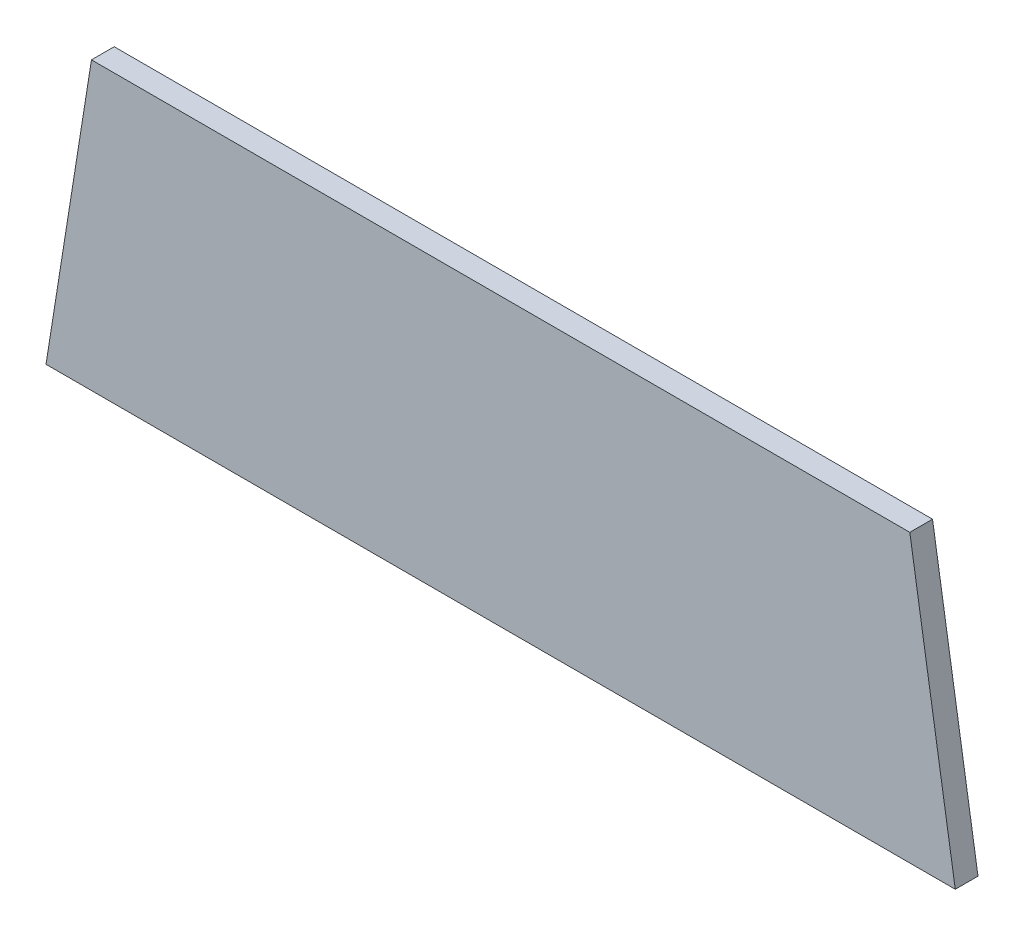
ISO-10303-21;
HEADER;
FILE_DESCRIPTION(('STEP AP214'),'2;1');
FILE_NAME('part.step','',(''),(''),'','','');
FILE_SCHEMA(('AUTOMOTIVE_DESIGN { 1 0 10303 214 1 1 1 1 }'));
ENDSEC;
DATA;
#1=APPLICATION_CONTEXT('core data for automotive mechanical design processes');
#2=APPLICATION_PROTOCOL_DEFINITION('international standard','automotive_design',2000,#1);
#3=PRODUCT_CONTEXT('',#1,'mechanical');
#4=PRODUCT('Part','Part','',(#3));
#5=PRODUCT_RELATED_PRODUCT_CATEGORY('part','',(#4));
#6=PRODUCT_DEFINITION_FORMATION('','',#4);
#7=PRODUCT_DEFINITION_CONTEXT('part definition',#1,'design');
#8=PRODUCT_DEFINITION('design','',#6,#7);
#9=PRODUCT_DEFINITION_SHAPE('','',#8);
#10=(LENGTH_UNIT() NAMED_UNIT(*) SI_UNIT(.MILLI.,.METRE.));
#11=(NAMED_UNIT(*) PLANE_ANGLE_UNIT() SI_UNIT($,.RADIAN.));
#12=(NAMED_UNIT(*) SI_UNIT($,.STERADIAN.) SOLID_ANGLE_UNIT());
#13=UNCERTAINTY_MEASURE_WITH_UNIT(LENGTH_MEASURE(1.E-05),#10,'distance_accuracy_value','');
#14=(GEOMETRIC_REPRESENTATION_CONTEXT(3) GLOBAL_UNCERTAINTY_ASSIGNED_CONTEXT((#13)) GLOBAL_UNIT_ASSIGNED_CONTEXT((#10,
#11,#12)) REPRESENTATION_CONTEXT('',''));
#15=CARTESIAN_POINT('',(0.,0.,0.));
#16=DIRECTION('',(0.,0.,1.));
#17=DIRECTION('',(1.,0.,0.));
#18=AXIS2_PLACEMENT_3D('',#15,#16,#17);
#19=CARTESIAN_POINT('',(-0.90000074,0.31500064,0.0499999));
#20=DIRECTION('',(0.,0.,1.));
#21=DIRECTION('',(1.,0.,0.));
#22=AXIS2_PLACEMENT_3D('',#19,#20,#21);
#23=PLANE('',#22);
#24=DIRECTION('',(-0.156766927688066,0.987635626323415,0.));
#25=VECTOR('',#24,1.);
#26=CARTESIAN_POINT('',(0.90000074,0.31500064,0.0499999));
#27=LINE('',#26,#25);
#28=CARTESIAN_POINT('',(0.90000074,0.31500064,0.0499999));
#29=VERTEX_POINT('',#28);
#30=CARTESIAN_POINT('',(1.00000053999998,-0.315000640000003,0.0499999));
#31=VERTEX_POINT('',#30);
#32=EDGE_CURVE('E52',#29,#31,#27,.F.);
#33=ORIENTED_EDGE('',*,*,#32,.F.);
#34=DIRECTION('',(1.,0.,0.));
#35=VECTOR('',#34,1.);
#36=CARTESIAN_POINT('',(-0.90000074,0.31500064,0.0499999));
#37=LINE('',#36,#35);
#38=CARTESIAN_POINT('',(-0.900000740000033,0.315000640000005,0.0499999));
#39=VERTEX_POINT('',#38);
#40=EDGE_CURVE('E67',#39,#29,#37,.T.);
#41=ORIENTED_EDGE('',*,*,#40,.F.);
#42=DIRECTION('',(-0.156766927688066,-0.987635626323415,0.));
#43=VECTOR('',#42,1.);
#44=CARTESIAN_POINT('',(-1.00000054,-0.31500064,0.0499999));
#45=LINE('',#44,#43);
#46=CARTESIAN_POINT('',(-1.00000054,-0.31500064,0.0499999));
#47=VERTEX_POINT('',#46);
#48=EDGE_CURVE('E19',#47,#39,#45,.F.);
#49=ORIENTED_EDGE('',*,*,#48,.F.);
#50=DIRECTION('',(1.,0.,0.));
#51=VECTOR('',#50,1.);
#52=CARTESIAN_POINT('',(1.00000054,-0.31500064,0.0499999));
#53=LINE('',#52,#51);
#54=EDGE_CURVE('E57',#31,#47,#53,.F.);
#55=ORIENTED_EDGE('',*,*,#54,.F.);
#56=EDGE_LOOP('',(#33,#41,#49,#55));
#57=FACE_BOUND('',#56,.T.);
#58=ADVANCED_FACE('F16',(#57),#23,.T.);
#59=CARTESIAN_POINT('',(-1.00000054,-0.31500064,0.));
#60=DIRECTION('',(-0.987635626323415,0.156766927688066,0.));
#61=DIRECTION('',(-0.156766927688066,-0.987635626323415,0.));
#62=AXIS2_PLACEMENT_3D('',#59,#60,#61);
#63=PLANE('',#62);
#64=DIRECTION('',(0.,0.,1.));
#65=VECTOR('',#64,1.);
#66=CARTESIAN_POINT('',(-0.90000074,0.31500064,0.));
#67=LINE('',#66,#65);
#68=CARTESIAN_POINT('',(-0.900000740000033,0.315000640000005,0.));
#69=VERTEX_POINT('',#68);
#70=EDGE_CURVE('E78',#69,#39,#67,.T.);
#71=ORIENTED_EDGE('',*,*,#70,.F.);
#72=DIRECTION('',(-0.15676692768817,-0.987635626323399,0.));
#73=VECTOR('',#72,1.);
#74=CARTESIAN_POINT('',(-0.90000074,0.31500064,0.));
#75=LINE('',#74,#73);
#76=CARTESIAN_POINT('',(-1.00000054,-0.31500064,0.));
#77=VERTEX_POINT('',#76);
#78=EDGE_CURVE('E73',#69,#77,#75,.T.);
#79=ORIENTED_EDGE('',*,*,#78,.T.);
#80=DIRECTION('',(0.,0.,-1.));
#81=VECTOR('',#80,1.);
#82=CARTESIAN_POINT('',(-1.00000054,-0.31500064,0.));
#83=LINE('',#82,#81);
#84=EDGE_CURVE('E62',#47,#77,#83,.T.);
#85=ORIENTED_EDGE('',*,*,#84,.F.);
#86=ORIENTED_EDGE('',*,*,#48,.T.);
#87=EDGE_LOOP('',(#71,#79,#85,#86));
#88=FACE_BOUND('',#87,.T.);
#89=ADVANCED_FACE('F72',(#88),#63,.T.);
#90=CARTESIAN_POINT('',(1.00000054,-0.31500064,0.));
#91=DIRECTION('',(0.,-1.,0.));
#92=DIRECTION('',(0.,0.,-1.));
#93=AXIS2_PLACEMENT_3D('',#90,#91,#92);
#94=PLANE('',#93);
#95=ORIENTED_EDGE('',*,*,#84,.T.);
#96=DIRECTION('',(1.,0.,0.));
#97=VECTOR('',#96,1.);
#98=CARTESIAN_POINT('',(-0.90000074,-0.31500064,0.));
#99=LINE('',#98,#97);
#100=CARTESIAN_POINT('',(1.00000053999998,-0.315000640000003,0.));
#101=VERTEX_POINT('',#100);
#102=EDGE_CURVE('E83',#77,#101,#99,.T.);
#103=ORIENTED_EDGE('',*,*,#102,.T.);
#104=DIRECTION('',(0.,0.,1.));
#105=VECTOR('',#104,1.);
#106=CARTESIAN_POINT('',(1.00000053999993,-0.315000640000011,0.));
#107=LINE('',#106,#105);
#108=EDGE_CURVE('E64',#31,#101,#107,.F.);
#109=ORIENTED_EDGE('',*,*,#108,.F.);
#110=ORIENTED_EDGE('',*,*,#54,.T.);
#111=EDGE_LOOP('',(#95,#103,#109,#110));
#112=FACE_BOUND('',#111,.T.);
#113=ADVANCED_FACE('F59',(#112),#94,.T.);
#114=CARTESIAN_POINT('',(0.90000074,0.31500064,0.));
#115=DIRECTION('',(0.987635626323415,0.156766927688066,0.));
#116=DIRECTION('',(-0.156766927688066,0.987635626323415,0.));
#117=AXIS2_PLACEMENT_3D('',#114,#115,#116);
#118=PLANE('',#117);
#119=ORIENTED_EDGE('',*,*,#108,.T.);
#120=DIRECTION('',(-0.15676692768817,0.987635626323399,0.));
#121=VECTOR('',#120,1.);
#122=CARTESIAN_POINT('',(1.00000054,-0.31500064,0.));
#123=LINE('',#122,#121);
#124=CARTESIAN_POINT('',(0.90000074,0.31500064,0.));
#125=VERTEX_POINT('',#124);
#126=EDGE_CURVE('E25',#101,#125,#123,.T.);
#127=ORIENTED_EDGE('',*,*,#126,.T.);
#128=DIRECTION('',(0.,0.,1.));
#129=VECTOR('',#128,1.);
#130=CARTESIAN_POINT('',(0.90000074,0.31500064,0.));
#131=LINE('',#130,#129);
#132=EDGE_CURVE('E33',#29,#125,#131,.F.);
#133=ORIENTED_EDGE('',*,*,#132,.F.);
#134=ORIENTED_EDGE('',*,*,#32,.T.);
#135=EDGE_LOOP('',(#119,#127,#133,#134));
#136=FACE_BOUND('',#135,.T.);
#137=ADVANCED_FACE('F87',(#136),#118,.T.);
#138=CARTESIAN_POINT('',(-0.90000074,0.31500064,0.));
#139=DIRECTION('',(0.,1.,0.));
#140=DIRECTION('',(0.,0.,1.));
#141=AXIS2_PLACEMENT_3D('',#138,#139,#140);
#142=PLANE('',#141);
#143=ORIENTED_EDGE('',*,*,#132,.T.);
#144=DIRECTION('',(1.,0.,0.));
#145=VECTOR('',#144,1.);
#146=CARTESIAN_POINT('',(-0.90000074,0.31500064,0.));
#147=LINE('',#146,#145);
#148=EDGE_CURVE('E11',#125,#69,#147,.F.);
#149=ORIENTED_EDGE('',*,*,#148,.T.);
#150=ORIENTED_EDGE('',*,*,#70,.T.);
#151=ORIENTED_EDGE('',*,*,#40,.T.);
#152=EDGE_LOOP('',(#143,#149,#150,#151));
#153=FACE_BOUND('',#152,.T.);
#154=ADVANCED_FACE('F90',(#153),#142,.T.);
#155=CARTESIAN_POINT('',(-0.90000074,0.31500064,0.));
#156=DIRECTION('',(0.,0.,1.));
#157=DIRECTION('',(1.,0.,0.));
#158=AXIS2_PLACEMENT_3D('',#155,#156,#157);
#159=PLANE('',#158);
#160=ORIENTED_EDGE('',*,*,#126,.F.);
#161=ORIENTED_EDGE('',*,*,#102,.F.);
#162=ORIENTED_EDGE('',*,*,#78,.F.);
#163=ORIENTED_EDGE('',*,*,#148,.F.);
#164=EDGE_LOOP('',(#160,#161,#162,#163));
#165=FACE_BOUND('',#164,.T.);
#166=ADVANCED_FACE('F89',(#165),#159,.F.);
#167=CLOSED_SHELL('',(#58,#89,#113,#137,#154,#166));
#168=MANIFOLD_SOLID_BREP('B1',#167);
#169=ADVANCED_BREP_SHAPE_REPRESENTATION('',(#18,#168),#14);
#170=SHAPE_DEFINITION_REPRESENTATION(#9,#169);
ENDSEC;
END-ISO-10303-21;
